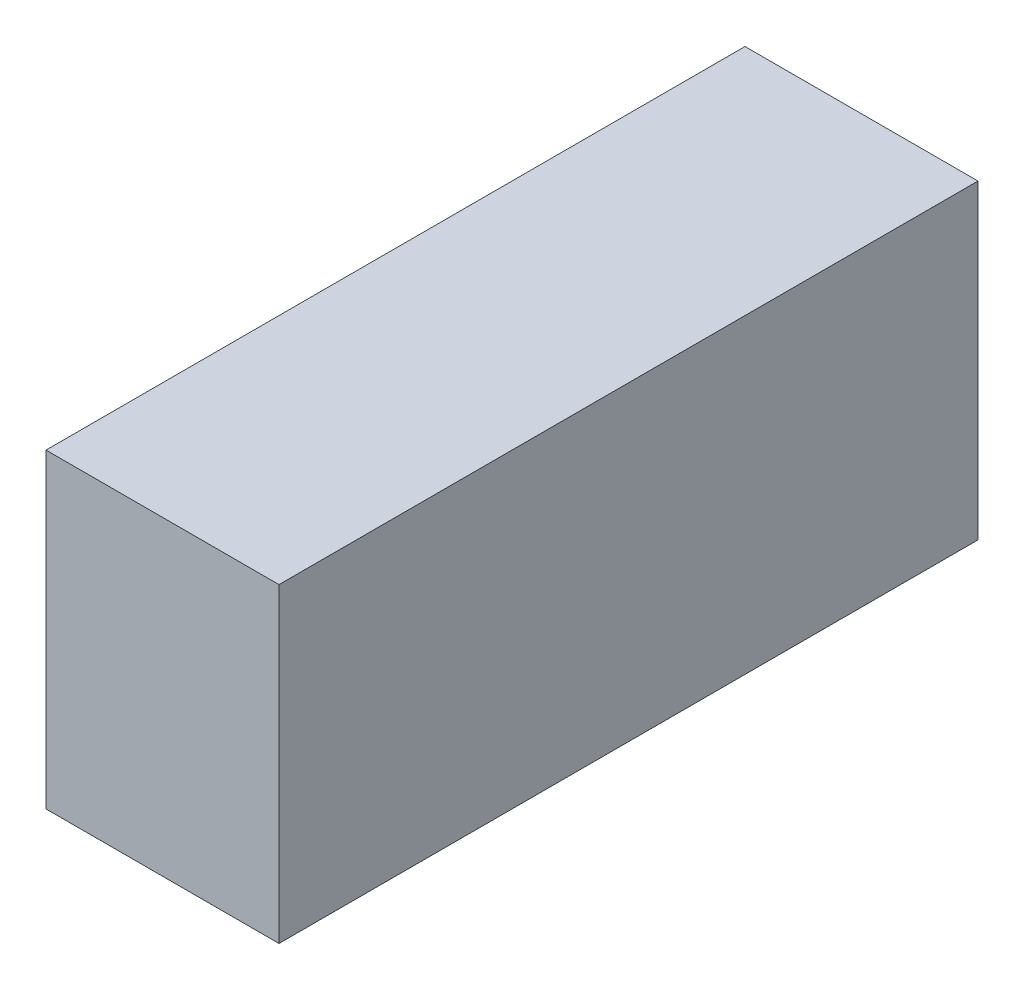
ISO-10303-21;
HEADER;
FILE_DESCRIPTION(('STEP AP214'),'2;1');
FILE_NAME('part.step','',(''),(''),'','','');
FILE_SCHEMA(('AUTOMOTIVE_DESIGN { 1 0 10303 214 1 1 1 1 }'));
ENDSEC;
DATA;
#1=APPLICATION_CONTEXT('core data for automotive mechanical design processes');
#2=APPLICATION_PROTOCOL_DEFINITION('international standard','automotive_design',2000,#1);
#3=PRODUCT_CONTEXT('',#1,'mechanical');
#4=PRODUCT('Part','Part','',(#3));
#5=PRODUCT_RELATED_PRODUCT_CATEGORY('part','',(#4));
#6=PRODUCT_DEFINITION_FORMATION('','',#4);
#7=PRODUCT_DEFINITION_CONTEXT('part definition',#1,'design');
#8=PRODUCT_DEFINITION('design','',#6,#7);
#9=PRODUCT_DEFINITION_SHAPE('','',#8);
#10=(LENGTH_UNIT() NAMED_UNIT(*) SI_UNIT(.MILLI.,.METRE.));
#11=(NAMED_UNIT(*) PLANE_ANGLE_UNIT() SI_UNIT($,.RADIAN.));
#12=(NAMED_UNIT(*) SI_UNIT($,.STERADIAN.) SOLID_ANGLE_UNIT());
#13=UNCERTAINTY_MEASURE_WITH_UNIT(LENGTH_MEASURE(1.E-05),#10,'distance_accuracy_value','');
#14=(GEOMETRIC_REPRESENTATION_CONTEXT(3) GLOBAL_UNCERTAINTY_ASSIGNED_CONTEXT((#13)) GLOBAL_UNIT_ASSIGNED_CONTEXT((#10,
#11,#12)) REPRESENTATION_CONTEXT('',''));
#15=CARTESIAN_POINT('',(0.,0.,0.));
#16=DIRECTION('',(0.,0.,1.));
#17=DIRECTION('',(1.,0.,0.));
#18=AXIS2_PLACEMENT_3D('',#15,#16,#17);
#19=CARTESIAN_POINT('',(-26.6700000000001,169.934556912664,449.58));
#20=DIRECTION('',(1.,0.,0.));
#21=DIRECTION('',(0.,1.,0.));
#22=AXIS2_PLACEMENT_3D('',#19,#20,#21);
#23=PLANE('',#22);
#24=DIRECTION('',(0.,-1.,0.));
#25=VECTOR('',#24,1.);
#26=CARTESIAN_POINT('',(-26.6700000000001,169.934556912664,0.));
#27=LINE('',#26,#25);
#28=CARTESIAN_POINT('',(-26.6700000000001,169.934556912664,0.));
#29=VERTEX_POINT('',#28);
#30=CARTESIAN_POINT('',(-26.6700000000001,-29.963443087336,0.));
#31=VERTEX_POINT('',#30);
#32=EDGE_CURVE('E72',#29,#31,#27,.T.);
#33=ORIENTED_EDGE('',*,*,#32,.T.);
#34=DIRECTION('',(0.,0.,-1.));
#35=VECTOR('',#34,1.);
#36=CARTESIAN_POINT('',(-26.6700000000001,-29.963443087336,449.58));
#37=LINE('',#36,#35);
#38=CARTESIAN_POINT('',(-26.6700000000001,-29.963443087336,449.58));
#39=VERTEX_POINT('',#38);
#40=EDGE_CURVE('E11',#39,#31,#37,.T.);
#41=ORIENTED_EDGE('',*,*,#40,.F.);
#42=DIRECTION('',(0.,-1.,0.));
#43=VECTOR('',#42,1.);
#44=CARTESIAN_POINT('',(-26.6700000000001,169.934556912664,449.58));
#45=LINE('',#44,#43);
#46=CARTESIAN_POINT('',(-26.6700000000001,169.934556912664,449.58));
#47=VERTEX_POINT('',#46);
#48=EDGE_CURVE('E66',#47,#39,#45,.T.);
#49=ORIENTED_EDGE('',*,*,#48,.F.);
#50=DIRECTION('',(0.,0.,-1.));
#51=VECTOR('',#50,1.);
#52=CARTESIAN_POINT('',(-26.6700000000001,169.934556912664,449.58));
#53=LINE('',#52,#51);
#54=EDGE_CURVE('E19',#47,#29,#53,.T.);
#55=ORIENTED_EDGE('',*,*,#54,.T.);
#56=EDGE_LOOP('',(#33,#41,#49,#55));
#57=FACE_BOUND('',#56,.T.);
#58=ADVANCED_FACE('F16',(#57),#23,.F.);
#59=CARTESIAN_POINT('',(-26.6700000000001,-29.963443087336,449.58));
#60=DIRECTION('',(0.,1.,0.));
#61=DIRECTION('',(-1.,0.,0.));
#62=AXIS2_PLACEMENT_3D('',#59,#60,#61);
#63=PLANE('',#62);
#64=DIRECTION('',(1.,0.,0.));
#65=VECTOR('',#64,1.);
#66=CARTESIAN_POINT('',(-26.6700000000001,-29.963443087336,0.));
#67=LINE('',#66,#65);
#68=CARTESIAN_POINT('',(123.19,-29.9634430873359,0.));
#69=VERTEX_POINT('',#68);
#70=EDGE_CURVE('E75',#31,#69,#67,.T.);
#71=ORIENTED_EDGE('',*,*,#70,.T.);
#72=DIRECTION('',(0.,0.,-1.));
#73=VECTOR('',#72,1.);
#74=CARTESIAN_POINT('',(123.19,-29.9634430873359,449.58));
#75=LINE('',#74,#73);
#76=CARTESIAN_POINT('',(123.19,-29.9634430873359,449.58));
#77=VERTEX_POINT('',#76);
#78=EDGE_CURVE('E24',#77,#69,#75,.T.);
#79=ORIENTED_EDGE('',*,*,#78,.F.);
#80=DIRECTION('',(1.,0.,0.));
#81=VECTOR('',#80,1.);
#82=CARTESIAN_POINT('',(-26.6700000000001,-29.963443087336,449.58));
#83=LINE('',#82,#81);
#84=EDGE_CURVE('E36',#39,#77,#83,.T.);
#85=ORIENTED_EDGE('',*,*,#84,.F.);
#86=ORIENTED_EDGE('',*,*,#40,.T.);
#87=EDGE_LOOP('',(#71,#79,#85,#86));
#88=FACE_BOUND('',#87,.T.);
#89=ADVANCED_FACE('F89',(#88),#63,.F.);
#90=CARTESIAN_POINT('',(123.19,-29.9634430873359,449.58));
#91=DIRECTION('',(-1.,0.,0.));
#92=DIRECTION('',(0.,-1.,0.));
#93=AXIS2_PLACEMENT_3D('',#90,#91,#92);
#94=PLANE('',#93);
#95=DIRECTION('',(0.,1.,0.));
#96=VECTOR('',#95,1.);
#97=CARTESIAN_POINT('',(123.19,-29.9634430873359,0.));
#98=LINE('',#97,#96);
#99=CARTESIAN_POINT('',(123.19,169.934556912664,0.));
#100=VERTEX_POINT('',#99);
#101=EDGE_CURVE('E67',#69,#100,#98,.T.);
#102=ORIENTED_EDGE('',*,*,#101,.T.);
#103=DIRECTION('',(0.,0.,-1.));
#104=VECTOR('',#103,1.);
#105=CARTESIAN_POINT('',(123.19,169.934556912664,449.58));
#106=LINE('',#105,#104);
#107=CARTESIAN_POINT('',(123.19,169.934556912664,449.58));
#108=VERTEX_POINT('',#107);
#109=EDGE_CURVE('E62',#108,#100,#106,.T.);
#110=ORIENTED_EDGE('',*,*,#109,.F.);
#111=DIRECTION('',(0.,1.,0.));
#112=VECTOR('',#111,1.);
#113=CARTESIAN_POINT('',(123.19,-29.9634430873359,449.58));
#114=LINE('',#113,#112);
#115=EDGE_CURVE('E31',#77,#108,#114,.T.);
#116=ORIENTED_EDGE('',*,*,#115,.F.);
#117=ORIENTED_EDGE('',*,*,#78,.T.);
#118=EDGE_LOOP('',(#102,#110,#116,#117));
#119=FACE_BOUND('',#118,.T.);
#120=ADVANCED_FACE('F87',(#119),#94,.F.);
#121=CARTESIAN_POINT('',(123.19,169.934556912664,449.58));
#122=DIRECTION('',(0.,-1.,0.));
#123=DIRECTION('',(0.,0.,-1.));
#124=AXIS2_PLACEMENT_3D('',#121,#122,#123);
#125=PLANE('',#124);
#126=DIRECTION('',(-1.,0.,0.));
#127=VECTOR('',#126,1.);
#128=CARTESIAN_POINT('',(123.19,169.934556912664,0.));
#129=LINE('',#128,#127);
#130=EDGE_CURVE('E57',#100,#29,#129,.T.);
#131=ORIENTED_EDGE('',*,*,#130,.T.);
#132=ORIENTED_EDGE('',*,*,#54,.F.);
#133=DIRECTION('',(-1.,0.,0.));
#134=VECTOR('',#133,1.);
#135=CARTESIAN_POINT('',(123.19,169.934556912664,449.58));
#136=LINE('',#135,#134);
#137=EDGE_CURVE('E73',#108,#47,#136,.T.);
#138=ORIENTED_EDGE('',*,*,#137,.F.);
#139=ORIENTED_EDGE('',*,*,#109,.T.);
#140=EDGE_LOOP('',(#131,#132,#138,#139));
#141=FACE_BOUND('',#140,.T.);
#142=ADVANCED_FACE('F59',(#141),#125,.F.);
#143=CARTESIAN_POINT('',(-26.6700000000001,-29.963443087336,449.58));
#144=DIRECTION('',(0.,0.,1.));
#145=DIRECTION('',(1.,0.,0.));
#146=AXIS2_PLACEMENT_3D('',#143,#144,#145);
#147=PLANE('',#146);
#148=ORIENTED_EDGE('',*,*,#48,.T.);
#149=ORIENTED_EDGE('',*,*,#84,.T.);
#150=ORIENTED_EDGE('',*,*,#115,.T.);
#151=ORIENTED_EDGE('',*,*,#137,.T.);
#152=EDGE_LOOP('',(#148,#149,#150,#151));
#153=FACE_BOUND('',#152,.T.);
#154=ADVANCED_FACE('F90',(#153),#147,.T.);
#155=CARTESIAN_POINT('',(-26.6700000000001,-29.963443087336,0.));
#156=DIRECTION('',(0.,0.,1.));
#157=DIRECTION('',(1.,0.,0.));
#158=AXIS2_PLACEMENT_3D('',#155,#156,#157);
#159=PLANE('',#158);
#160=ORIENTED_EDGE('',*,*,#32,.F.);
#161=ORIENTED_EDGE('',*,*,#130,.F.);
#162=ORIENTED_EDGE('',*,*,#101,.F.);
#163=ORIENTED_EDGE('',*,*,#70,.F.);
#164=EDGE_LOOP('',(#160,#161,#162,#163));
#165=FACE_BOUND('',#164,.T.);
#166=ADVANCED_FACE('F74',(#165),#159,.F.);
#167=CLOSED_SHELL('',(#58,#89,#120,#142,#154,#166));
#168=MANIFOLD_SOLID_BREP('B1',#167);
#169=ADVANCED_BREP_SHAPE_REPRESENTATION('',(#18,#168),#14);
#170=SHAPE_DEFINITION_REPRESENTATION(#9,#169);
ENDSEC;
END-ISO-10303-21;
